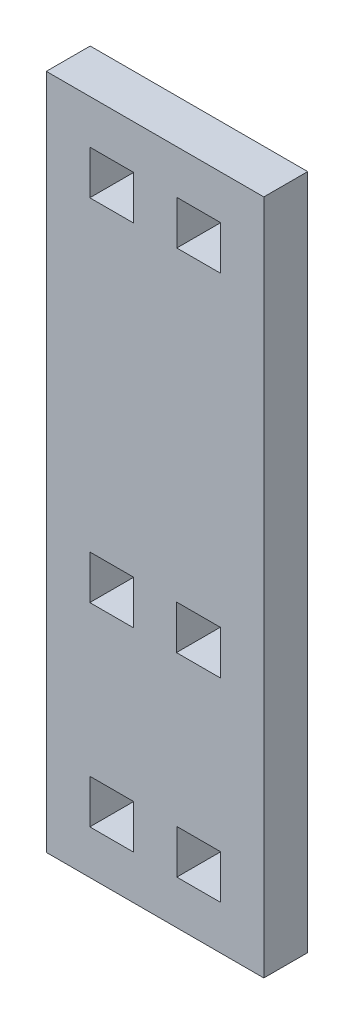
ISO-10303-21;
HEADER;
FILE_DESCRIPTION(('STEP AP214'),'2;1');
FILE_NAME('part.step','',(''),(''),'','','');
FILE_SCHEMA(('AUTOMOTIVE_DESIGN { 1 0 10303 214 1 1 1 1 }'));
ENDSEC;
DATA;
#1=APPLICATION_CONTEXT('core data for automotive mechanical design processes');
#2=APPLICATION_PROTOCOL_DEFINITION('international standard','automotive_design',2000,#1);
#3=PRODUCT_CONTEXT('',#1,'mechanical');
#4=PRODUCT('Part','Part','',(#3));
#5=PRODUCT_RELATED_PRODUCT_CATEGORY('part','',(#4));
#6=PRODUCT_DEFINITION_FORMATION('','',#4);
#7=PRODUCT_DEFINITION_CONTEXT('part definition',#1,'design');
#8=PRODUCT_DEFINITION('design','',#6,#7);
#9=PRODUCT_DEFINITION_SHAPE('','',#8);
#10=(LENGTH_UNIT() NAMED_UNIT(*) SI_UNIT(.MILLI.,.METRE.));
#11=(NAMED_UNIT(*) PLANE_ANGLE_UNIT() SI_UNIT($,.RADIAN.));
#12=(NAMED_UNIT(*) SI_UNIT($,.STERADIAN.) SOLID_ANGLE_UNIT());
#13=UNCERTAINTY_MEASURE_WITH_UNIT(LENGTH_MEASURE(1.E-05),#10,'distance_accuracy_value','');
#14=(GEOMETRIC_REPRESENTATION_CONTEXT(3) GLOBAL_UNCERTAINTY_ASSIGNED_CONTEXT((#13)) GLOBAL_UNIT_ASSIGNED_CONTEXT((#10,
#11,#12)) REPRESENTATION_CONTEXT('',''));
#15=CARTESIAN_POINT('',(0.,0.,0.));
#16=DIRECTION('',(0.,0.,1.));
#17=DIRECTION('',(1.,0.,0.));
#18=AXIS2_PLACEMENT_3D('',#15,#16,#17);
#19=CARTESIAN_POINT('',(0.,0.,5.15));
#20=DIRECTION('',(1.,0.,0.));
#21=DIRECTION('',(0.,0.,-1.));
#22=AXIS2_PLACEMENT_3D('',#19,#20,#21);
#23=PLANE('',#22);
#24=DIRECTION('',(0.,-1.,0.));
#25=VECTOR('',#24,1.);
#26=CARTESIAN_POINT('',(0.,0.,0.));
#27=LINE('',#26,#25);
#28=CARTESIAN_POINT('',(0.,79.4,0.));
#29=VERTEX_POINT('',#28);
#30=CARTESIAN_POINT('',(0.,0.,0.));
#31=VERTEX_POINT('',#30);
#32=EDGE_CURVE('E407',#29,#31,#27,.T.);
#33=ORIENTED_EDGE('',*,*,#32,.T.);
#34=DIRECTION('',(0.,0.,-1.));
#35=VECTOR('',#34,1.);
#36=CARTESIAN_POINT('',(0.,0.,5.15));
#37=LINE('',#36,#35);
#38=CARTESIAN_POINT('',(0.,0.,5.15));
#39=VERTEX_POINT('',#38);
#40=EDGE_CURVE('E11',#39,#31,#37,.T.);
#41=ORIENTED_EDGE('',*,*,#40,.F.);
#42=DIRECTION('',(0.,-1.,0.));
#43=VECTOR('',#42,1.);
#44=CARTESIAN_POINT('',(0.,0.,5.15));
#45=LINE('',#44,#43);
#46=CARTESIAN_POINT('',(0.,79.4,5.15));
#47=VERTEX_POINT('',#46);
#48=EDGE_CURVE('E414',#47,#39,#45,.T.);
#49=ORIENTED_EDGE('',*,*,#48,.F.);
#50=DIRECTION('',(0.,0.,-1.));
#51=VECTOR('',#50,1.);
#52=CARTESIAN_POINT('',(0.,79.4,5.15));
#53=LINE('',#52,#51);
#54=EDGE_CURVE('E424',#47,#29,#53,.T.);
#55=ORIENTED_EDGE('',*,*,#54,.T.);
#56=EDGE_LOOP('',(#33,#41,#49,#55));
#57=FACE_BOUND('',#56,.T.);
#58=ADVANCED_FACE('F33',(#57),#23,.F.);
#59=CARTESIAN_POINT('',(0.,0.,5.15));
#60=DIRECTION('',(0.,1.,0.));
#61=DIRECTION('',(0.,0.,1.));
#62=AXIS2_PLACEMENT_3D('',#59,#60,#61);
#63=PLANE('',#62);
#64=DIRECTION('',(1.,0.,0.));
#65=VECTOR('',#64,1.);
#66=CARTESIAN_POINT('',(0.,0.,0.));
#67=LINE('',#66,#65);
#68=CARTESIAN_POINT('',(25.53,0.,0.));
#69=VERTEX_POINT('',#68);
#70=EDGE_CURVE('E427',#31,#69,#67,.T.);
#71=ORIENTED_EDGE('',*,*,#70,.T.);
#72=DIRECTION('',(0.,0.,-1.));
#73=VECTOR('',#72,1.);
#74=CARTESIAN_POINT('',(25.53,0.,5.15));
#75=LINE('',#74,#73);
#76=CARTESIAN_POINT('',(25.53,0.,5.15));
#77=VERTEX_POINT('',#76);
#78=EDGE_CURVE('E40',#77,#69,#75,.T.);
#79=ORIENTED_EDGE('',*,*,#78,.F.);
#80=DIRECTION('',(1.,0.,0.));
#81=VECTOR('',#80,1.);
#82=CARTESIAN_POINT('',(0.,0.,5.15));
#83=LINE('',#82,#81);
#84=EDGE_CURVE('E417',#39,#77,#83,.T.);
#85=ORIENTED_EDGE('',*,*,#84,.F.);
#86=ORIENTED_EDGE('',*,*,#40,.T.);
#87=EDGE_LOOP('',(#71,#79,#85,#86));
#88=FACE_BOUND('',#87,.T.);
#89=ADVANCED_FACE('F456',(#88),#63,.F.);
#90=CARTESIAN_POINT('',(25.53,0.,5.15));
#91=DIRECTION('',(-1.,0.,0.));
#92=DIRECTION('',(0.,0.,1.));
#93=AXIS2_PLACEMENT_3D('',#90,#91,#92);
#94=PLANE('',#93);
#95=DIRECTION('',(0.,1.,0.));
#96=VECTOR('',#95,1.);
#97=CARTESIAN_POINT('',(25.53,0.,0.));
#98=LINE('',#97,#96);
#99=CARTESIAN_POINT('',(25.53,79.4,0.));
#100=VERTEX_POINT('',#99);
#101=EDGE_CURVE('E429',#69,#100,#98,.T.);
#102=ORIENTED_EDGE('',*,*,#101,.T.);
#103=DIRECTION('',(0.,0.,-1.));
#104=VECTOR('',#103,1.);
#105=CARTESIAN_POINT('',(25.53,79.4,5.15));
#106=LINE('',#105,#104);
#107=CARTESIAN_POINT('',(25.53,79.4,5.15));
#108=VERTEX_POINT('',#107);
#109=EDGE_CURVE('E434',#108,#100,#106,.T.);
#110=ORIENTED_EDGE('',*,*,#109,.F.);
#111=DIRECTION('',(0.,1.,0.));
#112=VECTOR('',#111,1.);
#113=CARTESIAN_POINT('',(25.53,0.,5.15));
#114=LINE('',#113,#112);
#115=EDGE_CURVE('E420',#77,#108,#114,.T.);
#116=ORIENTED_EDGE('',*,*,#115,.F.);
#117=ORIENTED_EDGE('',*,*,#78,.T.);
#118=EDGE_LOOP('',(#102,#110,#116,#117));
#119=FACE_BOUND('',#118,.T.);
#120=ADVANCED_FACE('F441',(#119),#94,.F.);
#121=CARTESIAN_POINT('',(0.,79.4,5.15));
#122=DIRECTION('',(0.,-1.,0.));
#123=DIRECTION('',(0.,0.,-1.));
#124=AXIS2_PLACEMENT_3D('',#121,#122,#123);
#125=PLANE('',#124);
#126=DIRECTION('',(-1.,0.,0.));
#127=VECTOR('',#126,1.);
#128=CARTESIAN_POINT('',(0.,79.4,0.));
#129=LINE('',#128,#127);
#130=EDGE_CURVE('E418',#100,#29,#129,.T.);
#131=ORIENTED_EDGE('',*,*,#130,.T.);
#132=ORIENTED_EDGE('',*,*,#54,.F.);
#133=DIRECTION('',(-1.,0.,0.));
#134=VECTOR('',#133,1.);
#135=CARTESIAN_POINT('',(0.,79.4,5.15));
#136=LINE('',#135,#134);
#137=EDGE_CURVE('E422',#108,#47,#136,.T.);
#138=ORIENTED_EDGE('',*,*,#137,.F.);
#139=ORIENTED_EDGE('',*,*,#109,.T.);
#140=EDGE_LOOP('',(#131,#132,#138,#139));
#141=FACE_BOUND('',#140,.T.);
#142=ADVANCED_FACE('F449',(#141),#125,.F.);
#143=CARTESIAN_POINT('',(0.,0.,5.15));
#144=DIRECTION('',(0.,0.,-1.));
#145=DIRECTION('',(-1.,0.,0.));
#146=AXIS2_PLACEMENT_3D('',#143,#144,#145);
#147=PLANE('',#146);
#148=DIRECTION('',(1.,0.,0.));
#149=VECTOR('',#148,1.);
#150=CARTESIAN_POINT('',(15.274,27.95,5.15));
#151=LINE('',#150,#149);
#152=CARTESIAN_POINT('',(15.274,27.95,5.15));
#153=VERTEX_POINT('',#152);
#154=CARTESIAN_POINT('',(20.424,27.95,5.15));
#155=VERTEX_POINT('',#154);
#156=EDGE_CURVE('E244',#153,#155,#151,.T.);
#157=ORIENTED_EDGE('',*,*,#156,.F.);
#158=DIRECTION('',(0.,-1.,0.));
#159=VECTOR('',#158,1.);
#160=CARTESIAN_POINT('',(15.274,33.1,5.15));
#161=LINE('',#160,#159);
#162=CARTESIAN_POINT('',(15.274,33.1,5.15));
#163=VERTEX_POINT('',#162);
#164=EDGE_CURVE('E47',#163,#153,#161,.T.);
#165=ORIENTED_EDGE('',*,*,#164,.F.);
#166=DIRECTION('',(-1.,0.,0.));
#167=VECTOR('',#166,1.);
#168=CARTESIAN_POINT('',(15.274,33.1,5.15));
#169=LINE('',#168,#167);
#170=CARTESIAN_POINT('',(20.424,33.1,5.15));
#171=VERTEX_POINT('',#170);
#172=EDGE_CURVE('E235',#171,#163,#169,.T.);
#173=ORIENTED_EDGE('',*,*,#172,.F.);
#174=DIRECTION('',(0.,1.,0.));
#175=VECTOR('',#174,1.);
#176=CARTESIAN_POINT('',(20.424,33.1,5.15));
#177=LINE('',#176,#175);
#178=EDGE_CURVE('E238',#155,#171,#177,.T.);
#179=ORIENTED_EDGE('',*,*,#178,.F.);
#180=EDGE_LOOP('',(#157,#165,#173,#179));
#181=FACE_BOUND('',#180,.T.);
#182=DIRECTION('',(1.,0.,0.));
#183=VECTOR('',#182,1.);
#184=CARTESIAN_POINT('',(5.106,27.95,5.15));
#185=LINE('',#184,#183);
#186=CARTESIAN_POINT('',(5.106,27.95,5.15));
#187=VERTEX_POINT('',#186);
#188=CARTESIAN_POINT('',(10.256,27.95,5.15));
#189=VERTEX_POINT('',#188);
#190=EDGE_CURVE('E269',#187,#189,#185,.T.);
#191=ORIENTED_EDGE('',*,*,#190,.F.);
#192=DIRECTION('',(0.,-1.,0.));
#193=VECTOR('',#192,1.);
#194=CARTESIAN_POINT('',(5.106,33.1,5.15));
#195=LINE('',#194,#193);
#196=CARTESIAN_POINT('',(5.106,33.1,5.15));
#197=VERTEX_POINT('',#196);
#198=EDGE_CURVE('E250',#197,#187,#195,.T.);
#199=ORIENTED_EDGE('',*,*,#198,.F.);
#200=DIRECTION('',(-1.,0.,0.));
#201=VECTOR('',#200,1.);
#202=CARTESIAN_POINT('',(5.106,33.1,5.15));
#203=LINE('',#202,#201);
#204=CARTESIAN_POINT('',(10.256,33.1,5.15));
#205=VERTEX_POINT('',#204);
#206=EDGE_CURVE('E258',#205,#197,#203,.T.);
#207=ORIENTED_EDGE('',*,*,#206,.F.);
#208=DIRECTION('',(0.,1.,0.));
#209=VECTOR('',#208,1.);
#210=CARTESIAN_POINT('',(10.256,33.1,5.15));
#211=LINE('',#210,#209);
#212=EDGE_CURVE('E272',#189,#205,#211,.T.);
#213=ORIENTED_EDGE('',*,*,#212,.F.);
#214=EDGE_LOOP('',(#191,#199,#207,#213));
#215=FACE_BOUND('',#214,.T.);
#216=DIRECTION('',(0.,1.,0.));
#217=VECTOR('',#216,1.);
#218=CARTESIAN_POINT('',(10.212,5.15,5.15));
#219=LINE('',#218,#217);
#220=CARTESIAN_POINT('',(10.212,5.15,5.15));
#221=VERTEX_POINT('',#220);
#222=CARTESIAN_POINT('',(10.212,10.3,5.15));
#223=VERTEX_POINT('',#222);
#224=EDGE_CURVE('E301',#221,#223,#219,.T.);
#225=ORIENTED_EDGE('',*,*,#224,.F.);
#226=DIRECTION('',(1.,0.,0.));
#227=VECTOR('',#226,1.);
#228=CARTESIAN_POINT('',(5.10600000000001,5.15,5.15));
#229=LINE('',#228,#227);
#230=CARTESIAN_POINT('',(5.10600000000001,5.15,5.15));
#231=VERTEX_POINT('',#230);
#232=EDGE_CURVE('E279',#231,#221,#229,.T.);
#233=ORIENTED_EDGE('',*,*,#232,.F.);
#234=DIRECTION('',(0.,-1.,0.));
#235=VECTOR('',#234,1.);
#236=CARTESIAN_POINT('',(5.10600000000001,5.15,5.15));
#237=LINE('',#236,#235);
#238=CARTESIAN_POINT('',(5.10600000000001,10.3,5.15));
#239=VERTEX_POINT('',#238);
#240=EDGE_CURVE('E290',#239,#231,#237,.T.);
#241=ORIENTED_EDGE('',*,*,#240,.F.);
#242=DIRECTION('',(-1.,0.,0.));
#243=VECTOR('',#242,1.);
#244=CARTESIAN_POINT('',(5.10600000000001,10.3,5.15));
#245=LINE('',#244,#243);
#246=EDGE_CURVE('E304',#223,#239,#245,.T.);
#247=ORIENTED_EDGE('',*,*,#246,.F.);
#248=EDGE_LOOP('',(#225,#233,#241,#247));
#249=FACE_BOUND('',#248,.T.);
#250=DIRECTION('',(0.,1.,0.));
#251=VECTOR('',#250,1.);
#252=CARTESIAN_POINT('',(20.424,5.15,5.15));
#253=LINE('',#252,#251);
#254=CARTESIAN_POINT('',(20.424,5.15,5.15));
#255=VERTEX_POINT('',#254);
#256=CARTESIAN_POINT('',(20.424,10.3,5.15));
#257=VERTEX_POINT('',#256);
#258=EDGE_CURVE('E333',#255,#257,#253,.T.);
#259=ORIENTED_EDGE('',*,*,#258,.F.);
#260=DIRECTION('',(1.,0.,0.));
#261=VECTOR('',#260,1.);
#262=CARTESIAN_POINT('',(15.318,5.15,5.15));
#263=LINE('',#262,#261);
#264=CARTESIAN_POINT('',(15.318,5.15,5.15));
#265=VERTEX_POINT('',#264);
#266=EDGE_CURVE('E311',#265,#255,#263,.T.);
#267=ORIENTED_EDGE('',*,*,#266,.F.);
#268=DIRECTION('',(0.,-1.,0.));
#269=VECTOR('',#268,1.);
#270=CARTESIAN_POINT('',(15.318,5.15,5.15));
#271=LINE('',#270,#269);
#272=CARTESIAN_POINT('',(15.318,10.3,5.15));
#273=VERTEX_POINT('',#272);
#274=EDGE_CURVE('E322',#273,#265,#271,.T.);
#275=ORIENTED_EDGE('',*,*,#274,.F.);
#276=DIRECTION('',(-1.,0.,0.));
#277=VECTOR('',#276,1.);
#278=CARTESIAN_POINT('',(15.318,10.3,5.15));
#279=LINE('',#278,#277);
#280=EDGE_CURVE('E336',#257,#273,#279,.T.);
#281=ORIENTED_EDGE('',*,*,#280,.F.);
#282=EDGE_LOOP('',(#259,#267,#275,#281));
#283=FACE_BOUND('',#282,.T.);
#284=DIRECTION('',(1.,0.,0.));
#285=VECTOR('',#284,1.);
#286=CARTESIAN_POINT('',(15.318,69.1,5.15));
#287=LINE('',#286,#285);
#288=CARTESIAN_POINT('',(15.318,69.1,5.15));
#289=VERTEX_POINT('',#288);
#290=CARTESIAN_POINT('',(20.424,69.1,5.15));
#291=VERTEX_POINT('',#290);
#292=EDGE_CURVE('E365',#289,#291,#287,.T.);
#293=ORIENTED_EDGE('',*,*,#292,.F.);
#294=DIRECTION('',(0.,-1.,0.));
#295=VECTOR('',#294,1.);
#296=CARTESIAN_POINT('',(15.318,74.25,5.15));
#297=LINE('',#296,#295);
#298=CARTESIAN_POINT('',(15.318,74.25,5.15));
#299=VERTEX_POINT('',#298);
#300=EDGE_CURVE('E343',#299,#289,#297,.T.);
#301=ORIENTED_EDGE('',*,*,#300,.F.);
#302=DIRECTION('',(-1.,0.,0.));
#303=VECTOR('',#302,1.);
#304=CARTESIAN_POINT('',(15.318,74.25,5.15));
#305=LINE('',#304,#303);
#306=CARTESIAN_POINT('',(20.424,74.25,5.15));
#307=VERTEX_POINT('',#306);
#308=EDGE_CURVE('E354',#307,#299,#305,.T.);
#309=ORIENTED_EDGE('',*,*,#308,.F.);
#310=DIRECTION('',(0.,1.,0.));
#311=VECTOR('',#310,1.);
#312=CARTESIAN_POINT('',(20.424,74.25,5.15));
#313=LINE('',#312,#311);
#314=EDGE_CURVE('E368',#291,#307,#313,.T.);
#315=ORIENTED_EDGE('',*,*,#314,.F.);
#316=EDGE_LOOP('',(#293,#301,#309,#315));
#317=FACE_BOUND('',#316,.T.);
#318=DIRECTION('',(1.,0.,0.));
#319=VECTOR('',#318,1.);
#320=CARTESIAN_POINT('',(5.106,69.1,5.15));
#321=LINE('',#320,#319);
#322=CARTESIAN_POINT('',(5.106,69.1,5.15));
#323=VERTEX_POINT('',#322);
#324=CARTESIAN_POINT('',(10.212,69.1,5.15));
#325=VERTEX_POINT('',#324);
#326=EDGE_CURVE('E397',#323,#325,#321,.T.);
#327=ORIENTED_EDGE('',*,*,#326,.F.);
#328=DIRECTION('',(0.,-1.,0.));
#329=VECTOR('',#328,1.);
#330=CARTESIAN_POINT('',(5.106,74.25,5.15));
#331=LINE('',#330,#329);
#332=CARTESIAN_POINT('',(5.106,74.25,5.15));
#333=VERTEX_POINT('',#332);
#334=EDGE_CURVE('E375',#333,#323,#331,.T.);
#335=ORIENTED_EDGE('',*,*,#334,.F.);
#336=DIRECTION('',(-1.,0.,0.));
#337=VECTOR('',#336,1.);
#338=CARTESIAN_POINT('',(5.106,74.25,5.15));
#339=LINE('',#338,#337);
#340=CARTESIAN_POINT('',(10.212,74.25,5.15));
#341=VERTEX_POINT('',#340);
#342=EDGE_CURVE('E386',#341,#333,#339,.T.);
#343=ORIENTED_EDGE('',*,*,#342,.F.);
#344=DIRECTION('',(0.,1.,0.));
#345=VECTOR('',#344,1.);
#346=CARTESIAN_POINT('',(10.212,74.25,5.15));
#347=LINE('',#346,#345);
#348=EDGE_CURVE('E400',#325,#341,#347,.T.);
#349=ORIENTED_EDGE('',*,*,#348,.F.);
#350=EDGE_LOOP('',(#327,#335,#343,#349));
#351=FACE_BOUND('',#350,.T.);
#352=ORIENTED_EDGE('',*,*,#48,.T.);
#353=ORIENTED_EDGE('',*,*,#84,.T.);
#354=ORIENTED_EDGE('',*,*,#115,.T.);
#355=ORIENTED_EDGE('',*,*,#137,.T.);
#356=EDGE_LOOP('',(#352,#353,#354,#355));
#357=FACE_BOUND('',#356,.T.);
#358=ADVANCED_FACE('F455',(#181,#215,#249,#283,#317,#351,#357),#147,.F.);
#359=CARTESIAN_POINT('',(0.,0.,0.));
#360=DIRECTION('',(0.,0.,-1.));
#361=DIRECTION('',(-1.,0.,0.));
#362=AXIS2_PLACEMENT_3D('',#359,#360,#361);
#363=PLANE('',#362);
#364=DIRECTION('',(0.,-1.,0.));
#365=VECTOR('',#364,1.);
#366=CARTESIAN_POINT('',(15.274,33.1,0.));
#367=LINE('',#366,#365);
#368=CARTESIAN_POINT('',(15.274,33.1,0.));
#369=VERTEX_POINT('',#368);
#370=CARTESIAN_POINT('',(15.274,27.95,0.));
#371=VERTEX_POINT('',#370);
#372=EDGE_CURVE('E219',#369,#371,#367,.T.);
#373=ORIENTED_EDGE('',*,*,#372,.T.);
#374=DIRECTION('',(1.,0.,0.));
#375=VECTOR('',#374,1.);
#376=CARTESIAN_POINT('',(15.274,27.95,0.));
#377=LINE('',#376,#375);
#378=CARTESIAN_POINT('',(20.424,27.95,0.));
#379=VERTEX_POINT('',#378);
#380=EDGE_CURVE('E228',#371,#379,#377,.T.);
#381=ORIENTED_EDGE('',*,*,#380,.T.);
#382=DIRECTION('',(0.,1.,0.));
#383=VECTOR('',#382,1.);
#384=CARTESIAN_POINT('',(20.424,33.1,0.));
#385=LINE('',#384,#383);
#386=CARTESIAN_POINT('',(20.424,33.1,0.));
#387=VERTEX_POINT('',#386);
#388=EDGE_CURVE('E55',#379,#387,#385,.T.);
#389=ORIENTED_EDGE('',*,*,#388,.T.);
#390=DIRECTION('',(-1.,0.,0.));
#391=VECTOR('',#390,1.);
#392=CARTESIAN_POINT('',(15.274,33.1,0.));
#393=LINE('',#392,#391);
#394=EDGE_CURVE('E225',#387,#369,#393,.T.);
#395=ORIENTED_EDGE('',*,*,#394,.T.);
#396=EDGE_LOOP('',(#373,#381,#389,#395));
#397=FACE_BOUND('',#396,.T.);
#398=DIRECTION('',(0.,-1.,0.));
#399=VECTOR('',#398,1.);
#400=CARTESIAN_POINT('',(5.106,33.1,0.));
#401=LINE('',#400,#399);
#402=CARTESIAN_POINT('',(5.106,33.1,0.));
#403=VERTEX_POINT('',#402);
#404=CARTESIAN_POINT('',(5.106,27.95,0.));
#405=VERTEX_POINT('',#404);
#406=EDGE_CURVE('E254',#403,#405,#401,.T.);
#407=ORIENTED_EDGE('',*,*,#406,.T.);
#408=DIRECTION('',(1.,0.,0.));
#409=VECTOR('',#408,1.);
#410=CARTESIAN_POINT('',(5.106,27.95,0.));
#411=LINE('',#410,#409);
#412=CARTESIAN_POINT('',(10.256,27.95,0.));
#413=VERTEX_POINT('',#412);
#414=EDGE_CURVE('E257',#405,#413,#411,.T.);
#415=ORIENTED_EDGE('',*,*,#414,.T.);
#416=DIRECTION('',(0.,1.,0.));
#417=VECTOR('',#416,1.);
#418=CARTESIAN_POINT('',(10.256,33.1,0.));
#419=LINE('',#418,#417);
#420=CARTESIAN_POINT('',(10.256,33.1,0.));
#421=VERTEX_POINT('',#420);
#422=EDGE_CURVE('E261',#413,#421,#419,.T.);
#423=ORIENTED_EDGE('',*,*,#422,.T.);
#424=DIRECTION('',(-1.,0.,0.));
#425=VECTOR('',#424,1.);
#426=CARTESIAN_POINT('',(5.106,33.1,0.));
#427=LINE('',#426,#425);
#428=EDGE_CURVE('E264',#421,#403,#427,.T.);
#429=ORIENTED_EDGE('',*,*,#428,.T.);
#430=EDGE_LOOP('',(#407,#415,#423,#429));
#431=FACE_BOUND('',#430,.T.);
#432=DIRECTION('',(1.,0.,0.));
#433=VECTOR('',#432,1.);
#434=CARTESIAN_POINT('',(5.10600000000001,5.15,0.));
#435=LINE('',#434,#433);
#436=CARTESIAN_POINT('',(5.10600000000001,5.15,0.));
#437=VERTEX_POINT('',#436);
#438=CARTESIAN_POINT('',(10.212,5.15,0.));
#439=VERTEX_POINT('',#438);
#440=EDGE_CURVE('E286',#437,#439,#435,.T.);
#441=ORIENTED_EDGE('',*,*,#440,.T.);
#442=DIRECTION('',(0.,1.,0.));
#443=VECTOR('',#442,1.);
#444=CARTESIAN_POINT('',(10.212,5.15,0.));
#445=LINE('',#444,#443);
#446=CARTESIAN_POINT('',(10.212,10.3,0.));
#447=VERTEX_POINT('',#446);
#448=EDGE_CURVE('E289',#439,#447,#445,.T.);
#449=ORIENTED_EDGE('',*,*,#448,.T.);
#450=DIRECTION('',(-1.,0.,0.));
#451=VECTOR('',#450,1.);
#452=CARTESIAN_POINT('',(5.10600000000001,10.3,0.));
#453=LINE('',#452,#451);
#454=CARTESIAN_POINT('',(5.10600000000001,10.3,0.));
#455=VERTEX_POINT('',#454);
#456=EDGE_CURVE('E293',#447,#455,#453,.T.);
#457=ORIENTED_EDGE('',*,*,#456,.T.);
#458=DIRECTION('',(0.,-1.,0.));
#459=VECTOR('',#458,1.);
#460=CARTESIAN_POINT('',(5.10600000000001,5.15,0.));
#461=LINE('',#460,#459);
#462=EDGE_CURVE('E296',#455,#437,#461,.T.);
#463=ORIENTED_EDGE('',*,*,#462,.T.);
#464=EDGE_LOOP('',(#441,#449,#457,#463));
#465=FACE_BOUND('',#464,.T.);
#466=DIRECTION('',(1.,0.,0.));
#467=VECTOR('',#466,1.);
#468=CARTESIAN_POINT('',(15.318,5.15,0.));
#469=LINE('',#468,#467);
#470=CARTESIAN_POINT('',(15.318,5.15,0.));
#471=VERTEX_POINT('',#470);
#472=CARTESIAN_POINT('',(20.424,5.15,0.));
#473=VERTEX_POINT('',#472);
#474=EDGE_CURVE('E318',#471,#473,#469,.T.);
#475=ORIENTED_EDGE('',*,*,#474,.T.);
#476=DIRECTION('',(0.,1.,0.));
#477=VECTOR('',#476,1.);
#478=CARTESIAN_POINT('',(20.424,5.15,0.));
#479=LINE('',#478,#477);
#480=CARTESIAN_POINT('',(20.424,10.3,0.));
#481=VERTEX_POINT('',#480);
#482=EDGE_CURVE('E321',#473,#481,#479,.T.);
#483=ORIENTED_EDGE('',*,*,#482,.T.);
#484=DIRECTION('',(-1.,0.,0.));
#485=VECTOR('',#484,1.);
#486=CARTESIAN_POINT('',(15.318,10.3,0.));
#487=LINE('',#486,#485);
#488=CARTESIAN_POINT('',(15.318,10.3,0.));
#489=VERTEX_POINT('',#488);
#490=EDGE_CURVE('E325',#481,#489,#487,.T.);
#491=ORIENTED_EDGE('',*,*,#490,.T.);
#492=DIRECTION('',(0.,-1.,0.));
#493=VECTOR('',#492,1.);
#494=CARTESIAN_POINT('',(15.318,5.15,0.));
#495=LINE('',#494,#493);
#496=EDGE_CURVE('E328',#489,#471,#495,.T.);
#497=ORIENTED_EDGE('',*,*,#496,.T.);
#498=EDGE_LOOP('',(#475,#483,#491,#497));
#499=FACE_BOUND('',#498,.T.);
#500=DIRECTION('',(0.,-1.,0.));
#501=VECTOR('',#500,1.);
#502=CARTESIAN_POINT('',(15.318,74.25,0.));
#503=LINE('',#502,#501);
#504=CARTESIAN_POINT('',(15.318,74.25,0.));
#505=VERTEX_POINT('',#504);
#506=CARTESIAN_POINT('',(15.318,69.1,0.));
#507=VERTEX_POINT('',#506);
#508=EDGE_CURVE('E350',#505,#507,#503,.T.);
#509=ORIENTED_EDGE('',*,*,#508,.T.);
#510=DIRECTION('',(1.,0.,0.));
#511=VECTOR('',#510,1.);
#512=CARTESIAN_POINT('',(15.318,69.1,0.));
#513=LINE('',#512,#511);
#514=CARTESIAN_POINT('',(20.424,69.1,0.));
#515=VERTEX_POINT('',#514);
#516=EDGE_CURVE('E353',#507,#515,#513,.T.);
#517=ORIENTED_EDGE('',*,*,#516,.T.);
#518=DIRECTION('',(0.,1.,0.));
#519=VECTOR('',#518,1.);
#520=CARTESIAN_POINT('',(20.424,74.25,0.));
#521=LINE('',#520,#519);
#522=CARTESIAN_POINT('',(20.424,74.25,0.));
#523=VERTEX_POINT('',#522);
#524=EDGE_CURVE('E357',#515,#523,#521,.T.);
#525=ORIENTED_EDGE('',*,*,#524,.T.);
#526=DIRECTION('',(-1.,0.,0.));
#527=VECTOR('',#526,1.);
#528=CARTESIAN_POINT('',(15.318,74.25,0.));
#529=LINE('',#528,#527);
#530=EDGE_CURVE('E360',#523,#505,#529,.T.);
#531=ORIENTED_EDGE('',*,*,#530,.T.);
#532=EDGE_LOOP('',(#509,#517,#525,#531));
#533=FACE_BOUND('',#532,.T.);
#534=DIRECTION('',(0.,-1.,0.));
#535=VECTOR('',#534,1.);
#536=CARTESIAN_POINT('',(5.106,74.25,0.));
#537=LINE('',#536,#535);
#538=CARTESIAN_POINT('',(5.106,74.25,0.));
#539=VERTEX_POINT('',#538);
#540=CARTESIAN_POINT('',(5.106,69.1,0.));
#541=VERTEX_POINT('',#540);
#542=EDGE_CURVE('E382',#539,#541,#537,.T.);
#543=ORIENTED_EDGE('',*,*,#542,.T.);
#544=DIRECTION('',(1.,0.,0.));
#545=VECTOR('',#544,1.);
#546=CARTESIAN_POINT('',(5.106,69.1,0.));
#547=LINE('',#546,#545);
#548=CARTESIAN_POINT('',(10.212,69.1,0.));
#549=VERTEX_POINT('',#548);
#550=EDGE_CURVE('E385',#541,#549,#547,.T.);
#551=ORIENTED_EDGE('',*,*,#550,.T.);
#552=DIRECTION('',(0.,1.,0.));
#553=VECTOR('',#552,1.);
#554=CARTESIAN_POINT('',(10.212,74.25,0.));
#555=LINE('',#554,#553);
#556=CARTESIAN_POINT('',(10.212,74.25,0.));
#557=VERTEX_POINT('',#556);
#558=EDGE_CURVE('E389',#549,#557,#555,.T.);
#559=ORIENTED_EDGE('',*,*,#558,.T.);
#560=DIRECTION('',(-1.,0.,0.));
#561=VECTOR('',#560,1.);
#562=CARTESIAN_POINT('',(5.106,74.25,0.));
#563=LINE('',#562,#561);
#564=EDGE_CURVE('E392',#557,#539,#563,.T.);
#565=ORIENTED_EDGE('',*,*,#564,.T.);
#566=EDGE_LOOP('',(#543,#551,#559,#565));
#567=FACE_BOUND('',#566,.T.);
#568=ORIENTED_EDGE('',*,*,#32,.F.);
#569=ORIENTED_EDGE('',*,*,#130,.F.);
#570=ORIENTED_EDGE('',*,*,#101,.F.);
#571=ORIENTED_EDGE('',*,*,#70,.F.);
#572=EDGE_LOOP('',(#568,#569,#570,#571));
#573=FACE_BOUND('',#572,.T.);
#574=ADVANCED_FACE('F232',(#397,#431,#465,#499,#533,#567,#573),#363,.T.);
#575=CARTESIAN_POINT('',(5.106,74.25,0.));
#576=DIRECTION('',(-1.,0.,0.));
#577=DIRECTION('',(0.,0.,1.));
#578=AXIS2_PLACEMENT_3D('',#575,#576,#577);
#579=PLANE('',#578);
#580=ORIENTED_EDGE('',*,*,#334,.T.);
#581=DIRECTION('',(0.,0.,1.));
#582=VECTOR('',#581,1.);
#583=CARTESIAN_POINT('',(5.106,69.1,0.));
#584=LINE('',#583,#582);
#585=EDGE_CURVE('E395',#541,#323,#584,.T.);
#586=ORIENTED_EDGE('',*,*,#585,.F.);
#587=ORIENTED_EDGE('',*,*,#542,.F.);
#588=DIRECTION('',(0.,0.,1.));
#589=VECTOR('',#588,1.);
#590=CARTESIAN_POINT('',(5.106,74.25,0.));
#591=LINE('',#590,#589);
#592=EDGE_CURVE('E405',#539,#333,#591,.T.);
#593=ORIENTED_EDGE('',*,*,#592,.T.);
#594=EDGE_LOOP('',(#580,#586,#587,#593));
#595=FACE_BOUND('',#594,.T.);
#596=ADVANCED_FACE('F468',(#595),#579,.F.);
#597=CARTESIAN_POINT('',(5.106,74.25,0.));
#598=DIRECTION('',(0.,1.,0.));
#599=DIRECTION('',(0.,0.,1.));
#600=AXIS2_PLACEMENT_3D('',#597,#598,#599);
#601=PLANE('',#600);
#602=ORIENTED_EDGE('',*,*,#342,.T.);
#603=ORIENTED_EDGE('',*,*,#592,.F.);
#604=ORIENTED_EDGE('',*,*,#564,.F.);
#605=DIRECTION('',(0.,0.,1.));
#606=VECTOR('',#605,1.);
#607=CARTESIAN_POINT('',(10.212,74.25,0.));
#608=LINE('',#607,#606);
#609=EDGE_CURVE('E408',#557,#341,#608,.T.);
#610=ORIENTED_EDGE('',*,*,#609,.T.);
#611=EDGE_LOOP('',(#602,#603,#604,#610));
#612=FACE_BOUND('',#611,.T.);
#613=ADVANCED_FACE('F474',(#612),#601,.F.);
#614=CARTESIAN_POINT('',(10.212,74.25,0.));
#615=DIRECTION('',(1.,0.,0.));
#616=DIRECTION('',(0.,0.,-1.));
#617=AXIS2_PLACEMENT_3D('',#614,#615,#616);
#618=PLANE('',#617);
#619=ORIENTED_EDGE('',*,*,#348,.T.);
#620=ORIENTED_EDGE('',*,*,#609,.F.);
#621=ORIENTED_EDGE('',*,*,#558,.F.);
#622=DIRECTION('',(0.,0.,1.));
#623=VECTOR('',#622,1.);
#624=CARTESIAN_POINT('',(10.212,69.1,0.));
#625=LINE('',#624,#623);
#626=EDGE_CURVE('E410',#549,#325,#625,.T.);
#627=ORIENTED_EDGE('',*,*,#626,.T.);
#628=EDGE_LOOP('',(#619,#620,#621,#627));
#629=FACE_BOUND('',#628,.T.);
#630=ADVANCED_FACE('F480',(#629),#618,.F.);
#631=CARTESIAN_POINT('',(5.106,69.1,0.));
#632=DIRECTION('',(0.,-1.,0.));
#633=DIRECTION('',(0.,0.,-1.));
#634=AXIS2_PLACEMENT_3D('',#631,#632,#633);
#635=PLANE('',#634);
#636=ORIENTED_EDGE('',*,*,#326,.T.);
#637=ORIENTED_EDGE('',*,*,#626,.F.);
#638=ORIENTED_EDGE('',*,*,#550,.F.);
#639=ORIENTED_EDGE('',*,*,#585,.T.);
#640=EDGE_LOOP('',(#636,#637,#638,#639));
#641=FACE_BOUND('',#640,.T.);
#642=ADVANCED_FACE('F476',(#641),#635,.F.);
#643=CARTESIAN_POINT('',(15.318,74.25,0.));
#644=DIRECTION('',(-1.,0.,0.));
#645=DIRECTION('',(0.,0.,1.));
#646=AXIS2_PLACEMENT_3D('',#643,#644,#645);
#647=PLANE('',#646);
#648=ORIENTED_EDGE('',*,*,#300,.T.);
#649=DIRECTION('',(0.,0.,1.));
#650=VECTOR('',#649,1.);
#651=CARTESIAN_POINT('',(15.318,69.1,0.));
#652=LINE('',#651,#650);
#653=EDGE_CURVE('E363',#507,#289,#652,.T.);
#654=ORIENTED_EDGE('',*,*,#653,.F.);
#655=ORIENTED_EDGE('',*,*,#508,.F.);
#656=DIRECTION('',(0.,0.,1.));
#657=VECTOR('',#656,1.);
#658=CARTESIAN_POINT('',(15.318,74.25,0.));
#659=LINE('',#658,#657);
#660=EDGE_CURVE('E373',#505,#299,#659,.T.);
#661=ORIENTED_EDGE('',*,*,#660,.T.);
#662=EDGE_LOOP('',(#648,#654,#655,#661));
#663=FACE_BOUND('',#662,.T.);
#664=ADVANCED_FACE('F479',(#663),#647,.F.);
#665=CARTESIAN_POINT('',(15.318,74.25,0.));
#666=DIRECTION('',(0.,1.,0.));
#667=DIRECTION('',(0.,0.,1.));
#668=AXIS2_PLACEMENT_3D('',#665,#666,#667);
#669=PLANE('',#668);
#670=ORIENTED_EDGE('',*,*,#308,.T.);
#671=ORIENTED_EDGE('',*,*,#660,.F.);
#672=ORIENTED_EDGE('',*,*,#530,.F.);
#673=DIRECTION('',(0.,0.,1.));
#674=VECTOR('',#673,1.);
#675=CARTESIAN_POINT('',(20.424,74.25,0.));
#676=LINE('',#675,#674);
#677=EDGE_CURVE('E376',#523,#307,#676,.T.);
#678=ORIENTED_EDGE('',*,*,#677,.T.);
#679=EDGE_LOOP('',(#670,#671,#672,#678));
#680=FACE_BOUND('',#679,.T.);
#681=ADVANCED_FACE('F490',(#680),#669,.F.);
#682=CARTESIAN_POINT('',(20.424,74.25,0.));
#683=DIRECTION('',(1.,0.,0.));
#684=DIRECTION('',(0.,0.,-1.));
#685=AXIS2_PLACEMENT_3D('',#682,#683,#684);
#686=PLANE('',#685);
#687=ORIENTED_EDGE('',*,*,#314,.T.);
#688=ORIENTED_EDGE('',*,*,#677,.F.);
#689=ORIENTED_EDGE('',*,*,#524,.F.);
#690=DIRECTION('',(0.,0.,1.));
#691=VECTOR('',#690,1.);
#692=CARTESIAN_POINT('',(20.424,69.1,0.));
#693=LINE('',#692,#691);
#694=EDGE_CURVE('E378',#515,#291,#693,.T.);
#695=ORIENTED_EDGE('',*,*,#694,.T.);
#696=EDGE_LOOP('',(#687,#688,#689,#695));
#697=FACE_BOUND('',#696,.T.);
#698=ADVANCED_FACE('F496',(#697),#686,.F.);
#699=CARTESIAN_POINT('',(15.318,69.1,0.));
#700=DIRECTION('',(0.,-1.,0.));
#701=DIRECTION('',(0.,0.,-1.));
#702=AXIS2_PLACEMENT_3D('',#699,#700,#701);
#703=PLANE('',#702);
#704=ORIENTED_EDGE('',*,*,#292,.T.);
#705=ORIENTED_EDGE('',*,*,#694,.F.);
#706=ORIENTED_EDGE('',*,*,#516,.F.);
#707=ORIENTED_EDGE('',*,*,#653,.T.);
#708=EDGE_LOOP('',(#704,#705,#706,#707));
#709=FACE_BOUND('',#708,.T.);
#710=ADVANCED_FACE('F492',(#709),#703,.F.);
#711=CARTESIAN_POINT('',(15.318,5.15,0.));
#712=DIRECTION('',(0.,-1.,0.));
#713=DIRECTION('',(1.,0.,0.));
#714=AXIS2_PLACEMENT_3D('',#711,#712,#713);
#715=PLANE('',#714);
#716=ORIENTED_EDGE('',*,*,#266,.T.);
#717=DIRECTION('',(0.,0.,1.));
#718=VECTOR('',#717,1.);
#719=CARTESIAN_POINT('',(20.424,5.15,0.));
#720=LINE('',#719,#718);
#721=EDGE_CURVE('E331',#473,#255,#720,.T.);
#722=ORIENTED_EDGE('',*,*,#721,.F.);
#723=ORIENTED_EDGE('',*,*,#474,.F.);
#724=DIRECTION('',(0.,0.,1.));
#725=VECTOR('',#724,1.);
#726=CARTESIAN_POINT('',(15.318,5.15,0.));
#727=LINE('',#726,#725);
#728=EDGE_CURVE('E341',#471,#265,#727,.T.);
#729=ORIENTED_EDGE('',*,*,#728,.T.);
#730=EDGE_LOOP('',(#716,#722,#723,#729));
#731=FACE_BOUND('',#730,.T.);
#732=ADVANCED_FACE('F495',(#731),#715,.F.);
#733=CARTESIAN_POINT('',(15.318,5.15,0.));
#734=DIRECTION('',(-1.,0.,0.));
#735=DIRECTION('',(0.,0.,1.));
#736=AXIS2_PLACEMENT_3D('',#733,#734,#735);
#737=PLANE('',#736);
#738=ORIENTED_EDGE('',*,*,#274,.T.);
#739=ORIENTED_EDGE('',*,*,#728,.F.);
#740=ORIENTED_EDGE('',*,*,#496,.F.);
#741=DIRECTION('',(0.,0.,1.));
#742=VECTOR('',#741,1.);
#743=CARTESIAN_POINT('',(15.318,10.3,0.));
#744=LINE('',#743,#742);
#745=EDGE_CURVE('E344',#489,#273,#744,.T.);
#746=ORIENTED_EDGE('',*,*,#745,.T.);
#747=EDGE_LOOP('',(#738,#739,#740,#746));
#748=FACE_BOUND('',#747,.T.);
#749=ADVANCED_FACE('F506',(#748),#737,.F.);
#750=CARTESIAN_POINT('',(15.318,10.3,0.));
#751=DIRECTION('',(0.,1.,0.));
#752=DIRECTION('',(0.,0.,1.));
#753=AXIS2_PLACEMENT_3D('',#750,#751,#752);
#754=PLANE('',#753);
#755=ORIENTED_EDGE('',*,*,#280,.T.);
#756=ORIENTED_EDGE('',*,*,#745,.F.);
#757=ORIENTED_EDGE('',*,*,#490,.F.);
#758=DIRECTION('',(0.,0.,1.));
#759=VECTOR('',#758,1.);
#760=CARTESIAN_POINT('',(20.424,10.3,0.));
#761=LINE('',#760,#759);
#762=EDGE_CURVE('E346',#481,#257,#761,.T.);
#763=ORIENTED_EDGE('',*,*,#762,.T.);
#764=EDGE_LOOP('',(#755,#756,#757,#763));
#765=FACE_BOUND('',#764,.T.);
#766=ADVANCED_FACE('F512',(#765),#754,.F.);
#767=CARTESIAN_POINT('',(20.424,5.15,0.));
#768=DIRECTION('',(1.,0.,0.));
#769=DIRECTION('',(0.,1.,0.));
#770=AXIS2_PLACEMENT_3D('',#767,#768,#769);
#771=PLANE('',#770);
#772=ORIENTED_EDGE('',*,*,#258,.T.);
#773=ORIENTED_EDGE('',*,*,#762,.F.);
#774=ORIENTED_EDGE('',*,*,#482,.F.);
#775=ORIENTED_EDGE('',*,*,#721,.T.);
#776=EDGE_LOOP('',(#772,#773,#774,#775));
#777=FACE_BOUND('',#776,.T.);
#778=ADVANCED_FACE('F508',(#777),#771,.F.);
#779=CARTESIAN_POINT('',(5.10600000000001,5.15,0.));
#780=DIRECTION('',(0.,-1.,0.));
#781=DIRECTION('',(1.,0.,0.));
#782=AXIS2_PLACEMENT_3D('',#779,#780,#781);
#783=PLANE('',#782);
#784=ORIENTED_EDGE('',*,*,#232,.T.);
#785=DIRECTION('',(0.,0.,1.));
#786=VECTOR('',#785,1.);
#787=CARTESIAN_POINT('',(10.212,5.15,0.));
#788=LINE('',#787,#786);
#789=EDGE_CURVE('E299',#439,#221,#788,.T.);
#790=ORIENTED_EDGE('',*,*,#789,.F.);
#791=ORIENTED_EDGE('',*,*,#440,.F.);
#792=DIRECTION('',(0.,0.,1.));
#793=VECTOR('',#792,1.);
#794=CARTESIAN_POINT('',(5.10600000000001,5.15,0.));
#795=LINE('',#794,#793);
#796=EDGE_CURVE('E309',#437,#231,#795,.T.);
#797=ORIENTED_EDGE('',*,*,#796,.T.);
#798=EDGE_LOOP('',(#784,#790,#791,#797));
#799=FACE_BOUND('',#798,.T.);
#800=ADVANCED_FACE('F511',(#799),#783,.F.);
#801=CARTESIAN_POINT('',(5.10600000000001,5.15,0.));
#802=DIRECTION('',(-1.,0.,0.));
#803=DIRECTION('',(0.,-1.,0.));
#804=AXIS2_PLACEMENT_3D('',#801,#802,#803);
#805=PLANE('',#804);
#806=ORIENTED_EDGE('',*,*,#240,.T.);
#807=ORIENTED_EDGE('',*,*,#796,.F.);
#808=ORIENTED_EDGE('',*,*,#462,.F.);
#809=DIRECTION('',(0.,0.,1.));
#810=VECTOR('',#809,1.);
#811=CARTESIAN_POINT('',(5.10600000000001,10.3,0.));
#812=LINE('',#811,#810);
#813=EDGE_CURVE('E312',#455,#239,#812,.T.);
#814=ORIENTED_EDGE('',*,*,#813,.T.);
#815=EDGE_LOOP('',(#806,#807,#808,#814));
#816=FACE_BOUND('',#815,.T.);
#817=ADVANCED_FACE('F522',(#816),#805,.F.);
#818=CARTESIAN_POINT('',(5.10600000000001,10.3,0.));
#819=DIRECTION('',(0.,1.,0.));
#820=DIRECTION('',(0.,0.,1.));
#821=AXIS2_PLACEMENT_3D('',#818,#819,#820);
#822=PLANE('',#821);
#823=ORIENTED_EDGE('',*,*,#246,.T.);
#824=ORIENTED_EDGE('',*,*,#813,.F.);
#825=ORIENTED_EDGE('',*,*,#456,.F.);
#826=DIRECTION('',(0.,0.,1.));
#827=VECTOR('',#826,1.);
#828=CARTESIAN_POINT('',(10.212,10.3,0.));
#829=LINE('',#828,#827);
#830=EDGE_CURVE('E314',#447,#223,#829,.T.);
#831=ORIENTED_EDGE('',*,*,#830,.T.);
#832=EDGE_LOOP('',(#823,#824,#825,#831));
#833=FACE_BOUND('',#832,.T.);
#834=ADVANCED_FACE('F528',(#833),#822,.F.);
#835=CARTESIAN_POINT('',(10.212,5.15,0.));
#836=DIRECTION('',(1.,0.,0.));
#837=DIRECTION('',(0.,1.,0.));
#838=AXIS2_PLACEMENT_3D('',#835,#836,#837);
#839=PLANE('',#838);
#840=ORIENTED_EDGE('',*,*,#224,.T.);
#841=ORIENTED_EDGE('',*,*,#830,.F.);
#842=ORIENTED_EDGE('',*,*,#448,.F.);
#843=ORIENTED_EDGE('',*,*,#789,.T.);
#844=EDGE_LOOP('',(#840,#841,#842,#843));
#845=FACE_BOUND('',#844,.T.);
#846=ADVANCED_FACE('F524',(#845),#839,.F.);
#847=CARTESIAN_POINT('',(5.106,33.1,0.));
#848=DIRECTION('',(-1.,0.,0.));
#849=DIRECTION('',(0.,-1.,0.));
#850=AXIS2_PLACEMENT_3D('',#847,#848,#849);
#851=PLANE('',#850);
#852=ORIENTED_EDGE('',*,*,#198,.T.);
#853=DIRECTION('',(0.,0.,1.));
#854=VECTOR('',#853,1.);
#855=CARTESIAN_POINT('',(5.106,27.95,0.));
#856=LINE('',#855,#854);
#857=EDGE_CURVE('E267',#405,#187,#856,.T.);
#858=ORIENTED_EDGE('',*,*,#857,.F.);
#859=ORIENTED_EDGE('',*,*,#406,.F.);
#860=DIRECTION('',(0.,0.,1.));
#861=VECTOR('',#860,1.);
#862=CARTESIAN_POINT('',(5.106,33.1,0.));
#863=LINE('',#862,#861);
#864=EDGE_CURVE('E277',#403,#197,#863,.T.);
#865=ORIENTED_EDGE('',*,*,#864,.T.);
#866=EDGE_LOOP('',(#852,#858,#859,#865));
#867=FACE_BOUND('',#866,.T.);
#868=ADVANCED_FACE('F527',(#867),#851,.F.);
#869=CARTESIAN_POINT('',(5.106,33.1,0.));
#870=DIRECTION('',(0.,1.,0.));
#871=DIRECTION('',(0.,0.,1.));
#872=AXIS2_PLACEMENT_3D('',#869,#870,#871);
#873=PLANE('',#872);
#874=ORIENTED_EDGE('',*,*,#206,.T.);
#875=ORIENTED_EDGE('',*,*,#864,.F.);
#876=ORIENTED_EDGE('',*,*,#428,.F.);
#877=DIRECTION('',(0.,0.,1.));
#878=VECTOR('',#877,1.);
#879=CARTESIAN_POINT('',(10.256,33.1,0.));
#880=LINE('',#879,#878);
#881=EDGE_CURVE('E280',#421,#205,#880,.T.);
#882=ORIENTED_EDGE('',*,*,#881,.T.);
#883=EDGE_LOOP('',(#874,#875,#876,#882));
#884=FACE_BOUND('',#883,.T.);
#885=ADVANCED_FACE('F538',(#884),#873,.F.);
#886=CARTESIAN_POINT('',(10.256,33.1,0.));
#887=DIRECTION('',(1.,0.,0.));
#888=DIRECTION('',(0.,0.,-1.));
#889=AXIS2_PLACEMENT_3D('',#886,#887,#888);
#890=PLANE('',#889);
#891=ORIENTED_EDGE('',*,*,#212,.T.);
#892=ORIENTED_EDGE('',*,*,#881,.F.);
#893=ORIENTED_EDGE('',*,*,#422,.F.);
#894=DIRECTION('',(0.,0.,1.));
#895=VECTOR('',#894,1.);
#896=CARTESIAN_POINT('',(10.256,27.95,0.));
#897=LINE('',#896,#895);
#898=EDGE_CURVE('E282',#413,#189,#897,.T.);
#899=ORIENTED_EDGE('',*,*,#898,.T.);
#900=EDGE_LOOP('',(#891,#892,#893,#899));
#901=FACE_BOUND('',#900,.T.);
#902=ADVANCED_FACE('F543',(#901),#890,.F.);
#903=CARTESIAN_POINT('',(5.106,27.95,0.));
#904=DIRECTION('',(0.,-1.,0.));
#905=DIRECTION('',(0.,0.,-1.));
#906=AXIS2_PLACEMENT_3D('',#903,#904,#905);
#907=PLANE('',#906);
#908=ORIENTED_EDGE('',*,*,#190,.T.);
#909=ORIENTED_EDGE('',*,*,#898,.F.);
#910=ORIENTED_EDGE('',*,*,#414,.F.);
#911=ORIENTED_EDGE('',*,*,#857,.T.);
#912=EDGE_LOOP('',(#908,#909,#910,#911));
#913=FACE_BOUND('',#912,.T.);
#914=ADVANCED_FACE('F540',(#913),#907,.F.);
#915=CARTESIAN_POINT('',(15.274,33.1,0.));
#916=DIRECTION('',(-1.,0.,0.));
#917=DIRECTION('',(0.,0.,1.));
#918=AXIS2_PLACEMENT_3D('',#915,#916,#917);
#919=PLANE('',#918);
#920=ORIENTED_EDGE('',*,*,#164,.T.);
#921=DIRECTION('',(0.,0.,1.));
#922=VECTOR('',#921,1.);
#923=CARTESIAN_POINT('',(15.274,27.95,0.));
#924=LINE('',#923,#922);
#925=EDGE_CURVE('E215',#371,#153,#924,.T.);
#926=ORIENTED_EDGE('',*,*,#925,.F.);
#927=ORIENTED_EDGE('',*,*,#372,.F.);
#928=DIRECTION('',(0.,0.,1.));
#929=VECTOR('',#928,1.);
#930=CARTESIAN_POINT('',(15.274,33.1,0.));
#931=LINE('',#930,#929);
#932=EDGE_CURVE('E248',#369,#163,#931,.T.);
#933=ORIENTED_EDGE('',*,*,#932,.T.);
#934=EDGE_LOOP('',(#920,#926,#927,#933));
#935=FACE_BOUND('',#934,.T.);
#936=ADVANCED_FACE('F217',(#935),#919,.F.);
#937=CARTESIAN_POINT('',(15.274,33.1,0.));
#938=DIRECTION('',(0.,1.,0.));
#939=DIRECTION('',(-1.,0.,0.));
#940=AXIS2_PLACEMENT_3D('',#937,#938,#939);
#941=PLANE('',#940);
#942=ORIENTED_EDGE('',*,*,#172,.T.);
#943=ORIENTED_EDGE('',*,*,#932,.F.);
#944=ORIENTED_EDGE('',*,*,#394,.F.);
#945=DIRECTION('',(0.,0.,1.));
#946=VECTOR('',#945,1.);
#947=CARTESIAN_POINT('',(20.424,33.1,0.));
#948=LINE('',#947,#946);
#949=EDGE_CURVE('E251',#387,#171,#948,.T.);
#950=ORIENTED_EDGE('',*,*,#949,.T.);
#951=EDGE_LOOP('',(#942,#943,#944,#950));
#952=FACE_BOUND('',#951,.T.);
#953=ADVANCED_FACE('F553',(#952),#941,.F.);
#954=CARTESIAN_POINT('',(20.424,33.1,0.));
#955=DIRECTION('',(1.,0.,0.));
#956=DIRECTION('',(0.,1.,0.));
#957=AXIS2_PLACEMENT_3D('',#954,#955,#956);
#958=PLANE('',#957);
#959=ORIENTED_EDGE('',*,*,#178,.T.);
#960=ORIENTED_EDGE('',*,*,#949,.F.);
#961=ORIENTED_EDGE('',*,*,#388,.F.);
#962=DIRECTION('',(0.,0.,1.));
#963=VECTOR('',#962,1.);
#964=CARTESIAN_POINT('',(20.424,27.95,0.));
#965=LINE('',#964,#963);
#966=EDGE_CURVE('E224',#379,#155,#965,.T.);
#967=ORIENTED_EDGE('',*,*,#966,.T.);
#968=EDGE_LOOP('',(#959,#960,#961,#967));
#969=FACE_BOUND('',#968,.T.);
#970=ADVANCED_FACE('F556',(#969),#958,.F.);
#971=CARTESIAN_POINT('',(15.274,27.95,0.));
#972=DIRECTION('',(0.,-1.,0.));
#973=DIRECTION('',(1.,0.,0.));
#974=AXIS2_PLACEMENT_3D('',#971,#972,#973);
#975=PLANE('',#974);
#976=ORIENTED_EDGE('',*,*,#156,.T.);
#977=ORIENTED_EDGE('',*,*,#966,.F.);
#978=ORIENTED_EDGE('',*,*,#380,.F.);
#979=ORIENTED_EDGE('',*,*,#925,.T.);
#980=EDGE_LOOP('',(#976,#977,#978,#979));
#981=FACE_BOUND('',#980,.T.);
#982=ADVANCED_FACE('F229',(#981),#975,.F.);
#983=CLOSED_SHELL('',(#58,#89,#120,#142,#358,#574,#596,#613,#630,#642,#664,#681,#698,#710,#732,
#749,#766,#778,#800,#817,#834,#846,#868,#885,#902,#914,#936,#953,#970,#982));
#984=MANIFOLD_SOLID_BREP('B2',#983);
#985=ADVANCED_BREP_SHAPE_REPRESENTATION('',(#18,#984),#14);
#986=SHAPE_DEFINITION_REPRESENTATION(#9,#985);
ENDSEC;
END-ISO-10303-21;
